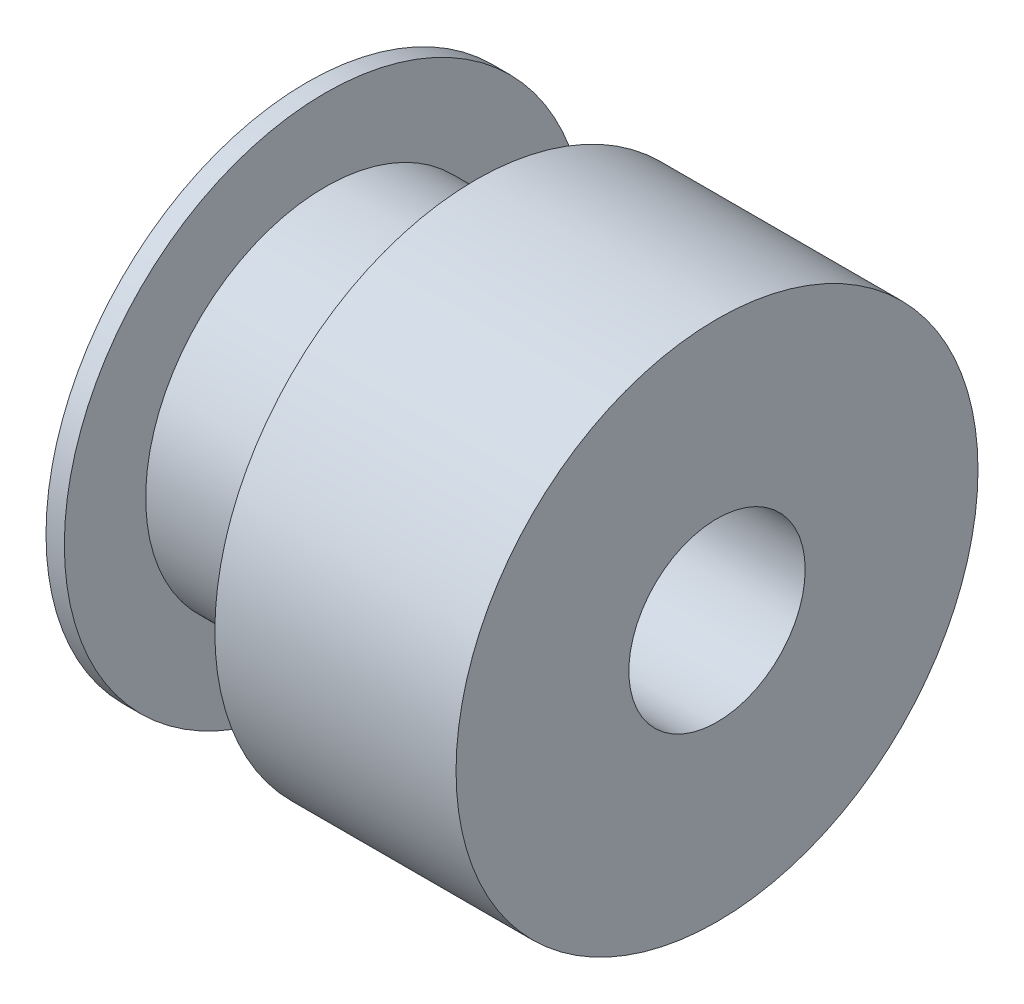
ISO-10303-21;
HEADER;
FILE_DESCRIPTION(('STEP AP214'),'2;1');
FILE_NAME('part.step','',(''),(''),'','','');
FILE_SCHEMA(('AUTOMOTIVE_DESIGN { 1 0 10303 214 1 1 1 1 }'));
ENDSEC;
DATA;
#1=APPLICATION_CONTEXT('core data for automotive mechanical design processes');
#2=APPLICATION_PROTOCOL_DEFINITION('international standard','automotive_design',2000,#1);
#3=PRODUCT_CONTEXT('',#1,'mechanical');
#4=PRODUCT('Part','Part','',(#3));
#5=PRODUCT_RELATED_PRODUCT_CATEGORY('part','',(#4));
#6=PRODUCT_DEFINITION_FORMATION('','',#4);
#7=PRODUCT_DEFINITION_CONTEXT('part definition',#1,'design');
#8=PRODUCT_DEFINITION('design','',#6,#7);
#9=PRODUCT_DEFINITION_SHAPE('','',#8);
#10=(LENGTH_UNIT() NAMED_UNIT(*) SI_UNIT(.MILLI.,.METRE.));
#11=(NAMED_UNIT(*) PLANE_ANGLE_UNIT() SI_UNIT($,.RADIAN.));
#12=(NAMED_UNIT(*) SI_UNIT($,.STERADIAN.) SOLID_ANGLE_UNIT());
#13=UNCERTAINTY_MEASURE_WITH_UNIT(LENGTH_MEASURE(1.E-05),#10,'distance_accuracy_value','');
#14=(GEOMETRIC_REPRESENTATION_CONTEXT(3) GLOBAL_UNCERTAINTY_ASSIGNED_CONTEXT((#13)) GLOBAL_UNIT_ASSIGNED_CONTEXT((#10,
#11,#12)) REPRESENTATION_CONTEXT('',''));
#15=CARTESIAN_POINT('',(0.,0.,0.));
#16=DIRECTION('',(0.,0.,1.));
#17=DIRECTION('',(1.,0.,0.));
#18=AXIS2_PLACEMENT_3D('',#15,#16,#17);
#19=CARTESIAN_POINT('',(0.4953,0.,0.));
#20=DIRECTION('',(1.,0.,0.));
#21=DIRECTION('',(0.,0.,-1.));
#22=AXIS2_PLACEMENT_3D('',#19,#20,#21);
#23=PLANE('',#22);
#24=CARTESIAN_POINT('',(0.4953,0.,0.));
#25=DIRECTION('',(1.,0.,0.));
#26=DIRECTION('',(0.,0.,-1.));
#27=AXIS2_PLACEMENT_3D('',#24,#25,#26);
#28=CIRCLE('',#27,7.0485);
#29=CARTESIAN_POINT('',(0.4953,0.,-7.0485));
#30=VERTEX_POINT('',#29);
#31=EDGE_CURVE('E10',#30,#30,#28,.T.);
#32=ORIENTED_EDGE('',*,*,#31,.T.);
#33=EDGE_LOOP('',(#32));
#34=FACE_BOUND('',#33,.T.);
#35=CARTESIAN_POINT('',(0.4953,0.,0.));
#36=DIRECTION('',(1.,0.,0.));
#37=DIRECTION('',(0.,0.,-1.));
#38=AXIS2_PLACEMENT_3D('',#35,#36,#37);
#39=CIRCLE('',#38,4.8514);
#40=CARTESIAN_POINT('',(0.4953,0.,-4.8514));
#41=VERTEX_POINT('',#40);
#42=EDGE_CURVE('E43',#41,#41,#39,.T.);
#43=ORIENTED_EDGE('',*,*,#42,.F.);
#44=EDGE_LOOP('',(#43));
#45=FACE_BOUND('',#44,.T.);
#46=ADVANCED_FACE('F30',(#34,#45),#23,.T.);
#47=CARTESIAN_POINT('',(0.4953,0.,0.));
#48=DIRECTION('',(-1.,0.,0.));
#49=DIRECTION('',(0.,0.,1.));
#50=AXIS2_PLACEMENT_3D('',#47,#48,#49);
#51=CYLINDRICAL_SURFACE('',#50,7.0485);
#52=ORIENTED_EDGE('',*,*,#31,.F.);
#53=EDGE_LOOP('',(#52));
#54=FACE_BOUND('',#53,.T.);
#55=CARTESIAN_POINT('',(0.,0.,0.));
#56=DIRECTION('',(1.,0.,0.));
#57=DIRECTION('',(0.,0.,-1.));
#58=AXIS2_PLACEMENT_3D('',#55,#56,#57);
#59=CIRCLE('',#58,7.0485);
#60=CARTESIAN_POINT('',(0.,0.,-7.0485));
#61=VERTEX_POINT('',#60);
#62=EDGE_CURVE('E34',#61,#61,#59,.T.);
#63=ORIENTED_EDGE('',*,*,#62,.T.);
#64=EDGE_LOOP('',(#63));
#65=FACE_BOUND('',#64,.T.);
#66=ADVANCED_FACE('F32',(#54,#65),#51,.T.);
#67=CARTESIAN_POINT('',(0.,0.,0.));
#68=DIRECTION('',(1.,0.,0.));
#69=DIRECTION('',(0.,0.,-1.));
#70=AXIS2_PLACEMENT_3D('',#67,#68,#69);
#71=PLANE('',#70);
#72=CARTESIAN_POINT('',(0.,0.,0.));
#73=DIRECTION('',(1.,0.,0.));
#74=DIRECTION('',(0.,0.,-1.));
#75=AXIS2_PLACEMENT_3D('',#72,#73,#74);
#76=CIRCLE('',#75,2.38125);
#77=CARTESIAN_POINT('',(0.,0.,-2.38125));
#78=VERTEX_POINT('',#77);
#79=EDGE_CURVE('E54',#78,#78,#76,.T.);
#80=ORIENTED_EDGE('',*,*,#79,.T.);
#81=EDGE_LOOP('',(#80));
#82=FACE_BOUND('',#81,.T.);
#83=ORIENTED_EDGE('',*,*,#62,.F.);
#84=EDGE_LOOP('',(#83));
#85=FACE_BOUND('',#84,.T.);
#86=ADVANCED_FACE('F61',(#82,#85),#71,.F.);
#87=CARTESIAN_POINT('',(4.5593,0.,0.));
#88=DIRECTION('',(-1.,0.,0.));
#89=DIRECTION('',(0.,0.,1.));
#90=AXIS2_PLACEMENT_3D('',#87,#88,#89);
#91=CYLINDRICAL_SURFACE('',#90,4.8514);
#92=CARTESIAN_POINT('',(4.5593,0.,0.));
#93=DIRECTION('',(1.,0.,0.));
#94=DIRECTION('',(0.,0.,-1.));
#95=AXIS2_PLACEMENT_3D('',#92,#93,#94);
#96=CIRCLE('',#95,4.8514);
#97=CARTESIAN_POINT('',(4.5593,0.,-4.8514));
#98=VERTEX_POINT('',#97);
#99=EDGE_CURVE('E41',#98,#98,#96,.T.);
#100=ORIENTED_EDGE('',*,*,#99,.F.);
#101=EDGE_LOOP('',(#100));
#102=FACE_BOUND('',#101,.T.);
#103=ORIENTED_EDGE('',*,*,#42,.T.);
#104=EDGE_LOOP('',(#103));
#105=FACE_BOUND('',#104,.T.);
#106=ADVANCED_FACE('F84',(#102,#105),#91,.T.);
#107=CARTESIAN_POINT('',(4.5593,0.,0.));
#108=DIRECTION('',(1.,0.,0.));
#109=DIRECTION('',(0.,0.,-1.));
#110=AXIS2_PLACEMENT_3D('',#107,#108,#109);
#111=PLANE('',#110);
#112=CARTESIAN_POINT('',(4.5593,0.,0.));
#113=DIRECTION('',(1.,0.,0.));
#114=DIRECTION('',(0.,0.,-1.));
#115=AXIS2_PLACEMENT_3D('',#112,#113,#114);
#116=CIRCLE('',#115,7.0485);
#117=CARTESIAN_POINT('',(4.5593,0.,-7.0485));
#118=VERTEX_POINT('',#117);
#119=EDGE_CURVE('E46',#118,#118,#116,.T.);
#120=ORIENTED_EDGE('',*,*,#119,.F.);
#121=EDGE_LOOP('',(#120));
#122=FACE_BOUND('',#121,.T.);
#123=ORIENTED_EDGE('',*,*,#99,.T.);
#124=EDGE_LOOP('',(#123));
#125=FACE_BOUND('',#124,.T.);
#126=ADVANCED_FACE('F78',(#122,#125),#111,.F.);
#127=CARTESIAN_POINT('',(5.0546,0.,0.));
#128=DIRECTION('',(-1.,0.,0.));
#129=DIRECTION('',(0.,0.,1.));
#130=AXIS2_PLACEMENT_3D('',#127,#128,#129);
#131=CYLINDRICAL_SURFACE('',#130,7.0485);
#132=ORIENTED_EDGE('',*,*,#119,.T.);
#133=EDGE_LOOP('',(#132));
#134=FACE_BOUND('',#133,.T.);
#135=CARTESIAN_POINT('',(11.0744,0.,0.));
#136=DIRECTION('',(1.,0.,0.));
#137=DIRECTION('',(0.,0.,-1.));
#138=AXIS2_PLACEMENT_3D('',#135,#136,#137);
#139=CIRCLE('',#138,7.0485);
#140=CARTESIAN_POINT('',(11.0744,0.,-7.0485));
#141=VERTEX_POINT('',#140);
#142=EDGE_CURVE('E51',#141,#141,#139,.T.);
#143=ORIENTED_EDGE('',*,*,#142,.F.);
#144=EDGE_LOOP('',(#143));
#145=FACE_BOUND('',#144,.T.);
#146=ADVANCED_FACE('F73',(#134,#145),#131,.T.);
#147=CARTESIAN_POINT('',(11.0744,0.,0.));
#148=DIRECTION('',(1.,0.,0.));
#149=DIRECTION('',(0.,0.,-1.));
#150=AXIS2_PLACEMENT_3D('',#147,#148,#149);
#151=PLANE('',#150);
#152=CARTESIAN_POINT('',(11.0744,0.,0.));
#153=DIRECTION('',(1.,0.,0.));
#154=DIRECTION('',(0.,0.,-1.));
#155=AXIS2_PLACEMENT_3D('',#152,#153,#154);
#156=CIRCLE('',#155,2.38125);
#157=CARTESIAN_POINT('',(11.0744,0.,-2.38125));
#158=VERTEX_POINT('',#157);
#159=EDGE_CURVE('E55',#158,#158,#156,.T.);
#160=ORIENTED_EDGE('',*,*,#159,.F.);
#161=EDGE_LOOP('',(#160));
#162=FACE_BOUND('',#161,.T.);
#163=ORIENTED_EDGE('',*,*,#142,.T.);
#164=EDGE_LOOP('',(#163));
#165=FACE_BOUND('',#164,.T.);
#166=ADVANCED_FACE('F67',(#162,#165),#151,.T.);
#167=CARTESIAN_POINT('',(0.,0.,0.));
#168=DIRECTION('',(1.,0.,0.));
#169=DIRECTION('',(0.,0.,-1.));
#170=AXIS2_PLACEMENT_3D('',#167,#168,#169);
#171=CYLINDRICAL_SURFACE('',#170,2.38125);
#172=ORIENTED_EDGE('',*,*,#79,.F.);
#173=EDGE_LOOP('',(#172));
#174=FACE_BOUND('',#173,.T.);
#175=ORIENTED_EDGE('',*,*,#159,.T.);
#176=EDGE_LOOP('',(#175));
#177=FACE_BOUND('',#176,.T.);
#178=ADVANCED_FACE('F64',(#174,#177),#171,.F.);
#179=CLOSED_SHELL('',(#46,#66,#86,#106,#126,#146,#166,#178));
#180=MANIFOLD_SOLID_BREP('B2',#179);
#181=ADVANCED_BREP_SHAPE_REPRESENTATION('',(#18,#180),#14);
#182=SHAPE_DEFINITION_REPRESENTATION(#9,#181);
ENDSEC;
END-ISO-10303-21;
